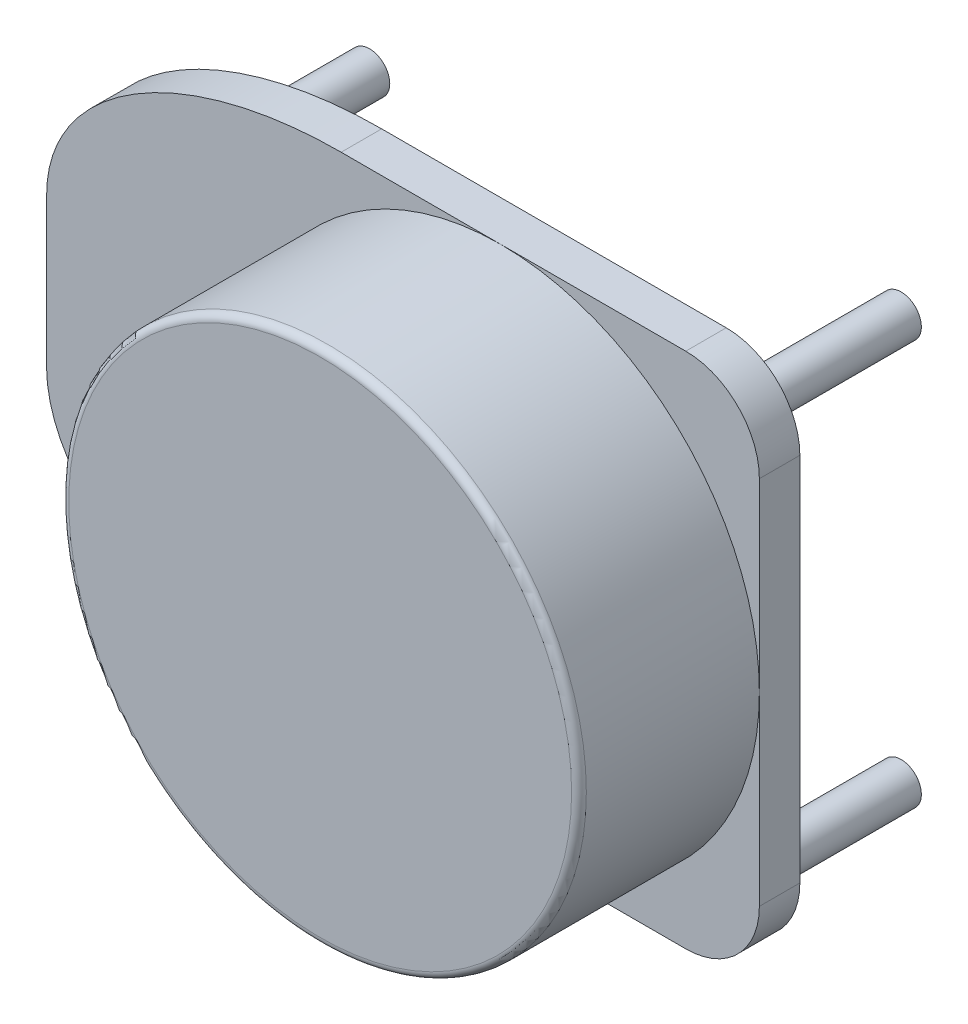
ISO-10303-21;
HEADER;
FILE_DESCRIPTION(('STEP AP214'),'2;1');
FILE_NAME('part.step','',(''),(''),'','','');
FILE_SCHEMA(('AUTOMOTIVE_DESIGN { 1 0 10303 214 1 1 1 1 }'));
ENDSEC;
DATA;
#1=APPLICATION_CONTEXT('core data for automotive mechanical design processes');
#2=APPLICATION_PROTOCOL_DEFINITION('international standard','automotive_design',2000,#1);
#3=PRODUCT_CONTEXT('',#1,'mechanical');
#4=PRODUCT('Part','Part','',(#3));
#5=PRODUCT_RELATED_PRODUCT_CATEGORY('part','',(#4));
#6=PRODUCT_DEFINITION_FORMATION('','',#4);
#7=PRODUCT_DEFINITION_CONTEXT('part definition',#1,'design');
#8=PRODUCT_DEFINITION('design','',#6,#7);
#9=PRODUCT_DEFINITION_SHAPE('','',#8);
#10=(LENGTH_UNIT() NAMED_UNIT(*) SI_UNIT(.MILLI.,.METRE.));
#11=(NAMED_UNIT(*) PLANE_ANGLE_UNIT() SI_UNIT($,.RADIAN.));
#12=(NAMED_UNIT(*) SI_UNIT($,.STERADIAN.) SOLID_ANGLE_UNIT());
#13=UNCERTAINTY_MEASURE_WITH_UNIT(LENGTH_MEASURE(1.E-05),#10,'distance_accuracy_value','');
#14=(GEOMETRIC_REPRESENTATION_CONTEXT(3) GLOBAL_UNCERTAINTY_ASSIGNED_CONTEXT((#13)) GLOBAL_UNIT_ASSIGNED_CONTEXT((#10,
#11,#12)) REPRESENTATION_CONTEXT('',''));
#15=CARTESIAN_POINT('',(0.,0.,0.));
#16=DIRECTION('',(0.,0.,1.));
#17=DIRECTION('',(1.,0.,0.));
#18=AXIS2_PLACEMENT_3D('',#15,#16,#17);
#19=CARTESIAN_POINT('',(-9.99999999999999,60.3,0.));
#20=DIRECTION('',(0.,0.,1.));
#21=DIRECTION('',(1.,0.,0.));
#22=AXIS2_PLACEMENT_3D('',#19,#20,#21);
#23=PLANE('',#22);
#24=CARTESIAN_POINT('',(-35.15,35.15,0.));
#25=DIRECTION('',(0.,0.,1.));
#26=DIRECTION('',(1.,0.,0.));
#27=AXIS2_PLACEMENT_3D('',#24,#25,#26);
#28=CIRCLE('',#27,35.15);
#29=CARTESIAN_POINT('',(0.,35.15,0.));
#30=VERTEX_POINT('',#29);
#31=CARTESIAN_POINT('',(-35.15,70.3,0.));
#32=VERTEX_POINT('',#31);
#33=EDGE_CURVE('E348',#30,#32,#28,.T.);
#34=ORIENTED_EDGE('',*,*,#33,.F.);
#35=DIRECTION('',(0.,1.,0.));
#36=VECTOR('',#35,1.);
#37=CARTESIAN_POINT('',(0.,10.0000000000001,0.));
#38=LINE('',#37,#36);
#39=CARTESIAN_POINT('',(0.,60.2999999999999,0.));
#40=VERTEX_POINT('',#39);
#41=EDGE_CURVE('E442',#30,#40,#38,.T.);
#42=ORIENTED_EDGE('',*,*,#41,.T.);
#43=CARTESIAN_POINT('',(-9.99999999999999,60.3,0.));
#44=DIRECTION('',(0.,0.,1.));
#45=DIRECTION('',(1.,0.,0.));
#46=AXIS2_PLACEMENT_3D('',#43,#44,#45);
#47=CIRCLE('',#46,10.);
#48=CARTESIAN_POINT('',(-10.0000000000001,70.3,0.));
#49=VERTEX_POINT('',#48);
#50=EDGE_CURVE('E354',#40,#49,#47,.T.);
#51=ORIENTED_EDGE('',*,*,#50,.T.);
#52=DIRECTION('',(-1.,0.,0.));
#53=VECTOR('',#52,1.);
#54=CARTESIAN_POINT('',(-10.0000000000001,70.3,0.));
#55=LINE('',#54,#53);
#56=EDGE_CURVE('E459',#49,#32,#55,.T.);
#57=ORIENTED_EDGE('',*,*,#56,.T.);
#58=EDGE_LOOP('',(#34,#42,#51,#57));
#59=FACE_BOUND('',#58,.T.);
#60=ADVANCED_FACE('F42',(#59),#23,.T.);
#61=CARTESIAN_POINT('',(-56.8,70.2999999999999,0.));
#62=VERTEX_POINT('',#61);
#63=EDGE_CURVE('E358',#32,#62,#55,.T.);
#64=ORIENTED_EDGE('',*,*,#63,.T.);
#65=CARTESIAN_POINT('',(-96.8,45.3,0.));
#66=CARTESIAN_POINT('',(-96.7999999999999,70.3,0.));
#67=CARTESIAN_POINT('',(-56.8,70.3,0.));
#68=(BOUNDED_CURVE() B_SPLINE_CURVE(2,(#65,#66,#67),.UNSPECIFIED.,.F.,
.F.) B_SPLINE_CURVE_WITH_KNOTS((3,3),(0.,1.),
.UNSPECIFIED.) CURVE() GEOMETRIC_REPRESENTATION_ITEM() RATIONAL_B_SPLINE_CURVE((1.,
0.707106781186548,1.)) REPRESENTATION_ITEM(''));
#69=CARTESIAN_POINT('',(-96.8,45.3,0.));
#70=VERTEX_POINT('',#69);
#71=EDGE_CURVE('E236',#62,#70,#68,.F.);
#72=ORIENTED_EDGE('',*,*,#71,.T.);
#73=DIRECTION('',(0.,1.,0.));
#74=VECTOR('',#73,1.);
#75=CARTESIAN_POINT('',(-96.8,0.,0.));
#76=LINE('',#75,#74);
#77=CARTESIAN_POINT('',(-96.8,25.,0.));
#78=VERTEX_POINT('',#77);
#79=EDGE_CURVE('E437',#78,#70,#76,.T.);
#80=ORIENTED_EDGE('',*,*,#79,.F.);
#81=CARTESIAN_POINT('',(-56.8,0.,0.));
#82=CARTESIAN_POINT('',(-96.8,0.,0.));
#83=CARTESIAN_POINT('',(-96.8,25.,0.));
#84=(BOUNDED_CURVE() B_SPLINE_CURVE(2,(#81,#82,#83),.UNSPECIFIED.,.F.,
.F.) B_SPLINE_CURVE_WITH_KNOTS((3,3),(0.,1.),
.UNSPECIFIED.) CURVE() GEOMETRIC_REPRESENTATION_ITEM() RATIONAL_B_SPLINE_CURVE((1.,
0.707106781186548,1.)) REPRESENTATION_ITEM(''));
#85=CARTESIAN_POINT('',(-56.8,0.,0.));
#86=VERTEX_POINT('',#85);
#87=EDGE_CURVE('E294',#78,#86,#84,.F.);
#88=ORIENTED_EDGE('',*,*,#87,.T.);
#89=DIRECTION('',(-1.,0.,0.));
#90=VECTOR('',#89,1.);
#91=CARTESIAN_POINT('',(-10.0000000000001,0.,0.));
#92=LINE('',#91,#90);
#93=CARTESIAN_POINT('',(-35.15,0.,0.));
#94=VERTEX_POINT('',#93);
#95=EDGE_CURVE('E436',#94,#86,#92,.T.);
#96=ORIENTED_EDGE('',*,*,#95,.F.);
#97=EDGE_CURVE('E341',#32,#94,#28,.T.);
#98=ORIENTED_EDGE('',*,*,#97,.F.);
#99=EDGE_LOOP('',(#64,#72,#80,#88,#96,#98));
#100=FACE_BOUND('',#99,.T.);
#101=ADVANCED_FACE('F417',(#100),#23,.T.);
#102=CARTESIAN_POINT('',(-9.99999999999999,60.3,-5.50000000000001));
#103=DIRECTION('',(0.,0.,1.));
#104=DIRECTION('',(1.,0.,0.));
#105=AXIS2_PLACEMENT_3D('',#102,#103,#104);
#106=CYLINDRICAL_SURFACE('',#105,10.);
#107=ORIENTED_EDGE('',*,*,#50,.F.);
#108=DIRECTION('',(0.,0.,1.));
#109=VECTOR('',#108,1.);
#110=CARTESIAN_POINT('',(0.,60.2999999999999,-5.50000000000001));
#111=LINE('',#110,#109);
#112=CARTESIAN_POINT('',(0.,60.2999999999999,-5.50000000000001));
#113=VERTEX_POINT('',#112);
#114=EDGE_CURVE('E352',#113,#40,#111,.T.);
#115=ORIENTED_EDGE('',*,*,#114,.F.);
#116=CARTESIAN_POINT('',(-9.99999999999999,60.3,-5.50000000000001));
#117=DIRECTION('',(0.,0.,1.));
#118=DIRECTION('',(1.,0.,0.));
#119=AXIS2_PLACEMENT_3D('',#116,#117,#118);
#120=CIRCLE('',#119,10.);
#121=CARTESIAN_POINT('',(-10.0000000000001,70.3,-5.50000000000001));
#122=VERTEX_POINT('',#121);
#123=EDGE_CURVE('E141',#113,#122,#120,.T.);
#124=ORIENTED_EDGE('',*,*,#123,.T.);
#125=DIRECTION('',(0.,0.,1.));
#126=VECTOR('',#125,1.);
#127=CARTESIAN_POINT('',(-10.0000000000001,70.3,-5.50000000000001));
#128=LINE('',#127,#126);
#129=EDGE_CURVE('E474',#122,#49,#128,.T.);
#130=ORIENTED_EDGE('',*,*,#129,.T.);
#131=EDGE_LOOP('',(#107,#115,#124,#130));
#132=FACE_BOUND('',#131,.T.);
#133=ADVANCED_FACE('F259',(#132),#106,.T.);
#134=CARTESIAN_POINT('',(0.,10.0000000000001,-5.50000000000001));
#135=DIRECTION('',(1.,0.,0.));
#136=DIRECTION('',(0.,0.,-1.));
#137=AXIS2_PLACEMENT_3D('',#134,#135,#136);
#138=PLANE('',#137);
#139=CARTESIAN_POINT('',(0.,9.99999999999998,0.));
#140=VERTEX_POINT('',#139);
#141=EDGE_CURVE('E434',#140,#30,#38,.T.);
#142=ORIENTED_EDGE('',*,*,#141,.F.);
#143=DIRECTION('',(0.,0.,1.));
#144=VECTOR('',#143,1.);
#145=CARTESIAN_POINT('',(0.,9.99999999999998,-5.50000000000001));
#146=LINE('',#145,#144);
#147=CARTESIAN_POINT('',(0.,9.99999999999998,-5.50000000000001));
#148=VERTEX_POINT('',#147);
#149=EDGE_CURVE('E480',#148,#140,#146,.T.);
#150=ORIENTED_EDGE('',*,*,#149,.F.);
#151=DIRECTION('',(0.,1.,0.));
#152=VECTOR('',#151,1.);
#153=CARTESIAN_POINT('',(0.,10.0000000000001,-5.50000000000001));
#154=LINE('',#153,#152);
#155=EDGE_CURVE('E472',#148,#113,#154,.T.);
#156=ORIENTED_EDGE('',*,*,#155,.T.);
#157=ORIENTED_EDGE('',*,*,#114,.T.);
#158=ORIENTED_EDGE('',*,*,#41,.F.);
#159=EDGE_LOOP('',(#142,#150,#156,#157,#158));
#160=FACE_BOUND('',#159,.T.);
#161=ADVANCED_FACE('F485',(#160),#138,.T.);
#162=CARTESIAN_POINT('',(-10.,9.99999999999998,-5.50000000000001));
#163=DIRECTION('',(0.,0.,1.));
#164=DIRECTION('',(1.,0.,0.));
#165=AXIS2_PLACEMENT_3D('',#162,#163,#164);
#166=CYLINDRICAL_SURFACE('',#165,10.);
#167=CARTESIAN_POINT('',(-10.,9.99999999999998,0.));
#168=DIRECTION('',(0.,0.,1.));
#169=DIRECTION('',(1.,0.,0.));
#170=AXIS2_PLACEMENT_3D('',#167,#168,#169);
#171=CIRCLE('',#170,10.);
#172=CARTESIAN_POINT('',(-10.0000000000001,0.,0.));
#173=VERTEX_POINT('',#172);
#174=EDGE_CURVE('E440',#173,#140,#171,.T.);
#175=ORIENTED_EDGE('',*,*,#174,.F.);
#176=DIRECTION('',(0.,0.,1.));
#177=VECTOR('',#176,1.);
#178=CARTESIAN_POINT('',(-10.0000000000001,0.,-5.50000000000001));
#179=LINE('',#178,#177);
#180=CARTESIAN_POINT('',(-10.0000000000001,0.,-5.50000000000001));
#181=VERTEX_POINT('',#180);
#182=EDGE_CURVE('E439',#181,#173,#179,.T.);
#183=ORIENTED_EDGE('',*,*,#182,.F.);
#184=CARTESIAN_POINT('',(-10.,9.99999999999998,-5.50000000000001));
#185=DIRECTION('',(0.,0.,1.));
#186=DIRECTION('',(1.,0.,0.));
#187=AXIS2_PLACEMENT_3D('',#184,#185,#186);
#188=CIRCLE('',#187,10.);
#189=EDGE_CURVE('E195',#181,#148,#188,.T.);
#190=ORIENTED_EDGE('',*,*,#189,.T.);
#191=ORIENTED_EDGE('',*,*,#149,.T.);
#192=EDGE_LOOP('',(#175,#183,#190,#191));
#193=FACE_BOUND('',#192,.T.);
#194=ADVANCED_FACE('F479',(#193),#166,.T.);
#195=CARTESIAN_POINT('',(-10.0000000000001,0.,-5.50000000000001));
#196=DIRECTION('',(0.,1.,0.));
#197=DIRECTION('',(0.,0.,1.));
#198=AXIS2_PLACEMENT_3D('',#195,#196,#197);
#199=PLANE('',#198);
#200=ORIENTED_EDGE('',*,*,#95,.T.);
#201=CARTESIAN_POINT('',(-56.8,0.,-5.77499999999997));
#202=CARTESIAN_POINT('',(-56.8,0.,-3.75833333333336));
#203=CARTESIAN_POINT('',(-56.8,0.,-1.74166666666664));
#204=CARTESIAN_POINT('',(-56.8,0.,0.275000000000025));
#205=(BOUNDED_CURVE() B_SPLINE_CURVE(3,(#201,#202,#203,#204),.UNSPECIFIED.,.F.,
.F.) B_SPLINE_CURVE_WITH_KNOTS((4,4),(-0.000275,0.005775),
.UNSPECIFIED.) CURVE() GEOMETRIC_REPRESENTATION_ITEM() RATIONAL_B_SPLINE_CURVE((1.,1.,1.,1.)) REPRESENTATION_ITEM(''));
#206=CARTESIAN_POINT('',(-56.8,0.,-5.50000000000001));
#207=VERTEX_POINT('',#206);
#208=EDGE_CURVE('E56',#86,#207,#205,.F.);
#209=ORIENTED_EDGE('',*,*,#208,.T.);
#210=DIRECTION('',(-1.,0.,0.));
#211=VECTOR('',#210,1.);
#212=CARTESIAN_POINT('',(-10.0000000000001,0.,-5.50000000000001));
#213=LINE('',#212,#211);
#214=EDGE_CURVE('E130',#181,#207,#213,.T.);
#215=ORIENTED_EDGE('',*,*,#214,.F.);
#216=ORIENTED_EDGE('',*,*,#182,.T.);
#217=EDGE_CURVE('E431',#173,#94,#92,.T.);
#218=ORIENTED_EDGE('',*,*,#217,.T.);
#219=EDGE_LOOP('',(#200,#209,#215,#216,#218));
#220=FACE_BOUND('',#219,.T.);
#221=ADVANCED_FACE('F181',(#220),#199,.F.);
#222=CARTESIAN_POINT('',(-96.8,0.,-5.50000000000001));
#223=DIRECTION('',(1.,0.,0.));
#224=DIRECTION('',(0.,0.,-1.));
#225=AXIS2_PLACEMENT_3D('',#222,#223,#224);
#226=PLANE('',#225);
#227=ORIENTED_EDGE('',*,*,#79,.T.);
#228=CARTESIAN_POINT('',(-96.8,45.3,-5.77499999999997));
#229=CARTESIAN_POINT('',(-96.8,45.3,-3.75833333333331));
#230=CARTESIAN_POINT('',(-96.8,45.3,-1.74166666666664));
#231=CARTESIAN_POINT('',(-96.8,45.3,0.275000000000025));
#232=(BOUNDED_CURVE() B_SPLINE_CURVE(3,(#228,#229,#230,#231),.UNSPECIFIED.,.F.,
.F.) B_SPLINE_CURVE_WITH_KNOTS((4,4),(-0.005775,0.000275),
.UNSPECIFIED.) CURVE() GEOMETRIC_REPRESENTATION_ITEM() RATIONAL_B_SPLINE_CURVE((1.,1.,1.,1.)) REPRESENTATION_ITEM(''));
#233=CARTESIAN_POINT('',(-96.8,45.3,-5.50000000000001));
#234=VERTEX_POINT('',#233);
#235=EDGE_CURVE('E135',#70,#234,#232,.F.);
#236=ORIENTED_EDGE('',*,*,#235,.T.);
#237=DIRECTION('',(0.,1.,0.));
#238=VECTOR('',#237,1.);
#239=CARTESIAN_POINT('',(-96.8,0.,-5.50000000000001));
#240=LINE('',#239,#238);
#241=CARTESIAN_POINT('',(-96.8,35.15,-5.50000000000001));
#242=VERTEX_POINT('',#241);
#243=EDGE_CURVE('E65',#242,#234,#240,.T.);
#244=ORIENTED_EDGE('',*,*,#243,.F.);
#245=CARTESIAN_POINT('',(-96.8,25.,-5.50000000000001));
#246=VERTEX_POINT('',#245);
#247=EDGE_CURVE('E120',#246,#242,#240,.T.);
#248=ORIENTED_EDGE('',*,*,#247,.F.);
#249=CARTESIAN_POINT('',(-96.8,25.,0.275000000000025));
#250=CARTESIAN_POINT('',(-96.8,25.,-1.74166666666664));
#251=CARTESIAN_POINT('',(-96.8,25.,-3.75833333333336));
#252=CARTESIAN_POINT('',(-96.8,25.,-5.77499999999997));
#253=(BOUNDED_CURVE() B_SPLINE_CURVE(3,(#249,#250,#251,#252),.UNSPECIFIED.,.F.,
.F.) B_SPLINE_CURVE_WITH_KNOTS((4,4),(-0.000275,0.005775),
.UNSPECIFIED.) CURVE() GEOMETRIC_REPRESENTATION_ITEM() RATIONAL_B_SPLINE_CURVE((1.,1.,1.,1.)) REPRESENTATION_ITEM(''));
#254=EDGE_CURVE('E165',#246,#78,#253,.F.);
#255=ORIENTED_EDGE('',*,*,#254,.T.);
#256=EDGE_LOOP('',(#227,#236,#244,#248,#255));
#257=FACE_BOUND('',#256,.T.);
#258=ADVANCED_FACE('F133',(#257),#226,.F.);
#259=CARTESIAN_POINT('',(-10.0000000000001,70.3,-5.50000000000001));
#260=DIRECTION('',(0.,1.,0.));
#261=DIRECTION('',(-1.,0.,0.));
#262=AXIS2_PLACEMENT_3D('',#259,#260,#261);
#263=PLANE('',#262);
#264=DIRECTION('',(-1.,0.,0.));
#265=VECTOR('',#264,1.);
#266=CARTESIAN_POINT('',(-10.0000000000001,70.3,-5.50000000000001));
#267=LINE('',#266,#265);
#268=CARTESIAN_POINT('',(-56.8,70.2999999999999,-5.50000000000001));
#269=VERTEX_POINT('',#268);
#270=EDGE_CURVE('E138',#122,#269,#267,.T.);
#271=ORIENTED_EDGE('',*,*,#270,.T.);
#272=CARTESIAN_POINT('',(-56.8,70.3,0.275000000000025));
#273=CARTESIAN_POINT('',(-56.8,70.3,-1.74166666666664));
#274=CARTESIAN_POINT('',(-56.8,70.3,-3.75833333333331));
#275=CARTESIAN_POINT('',(-56.8,70.3,-5.77499999999997));
#276=(BOUNDED_CURVE() B_SPLINE_CURVE(3,(#272,#273,#274,#275),.UNSPECIFIED.,.F.,
.F.) B_SPLINE_CURVE_WITH_KNOTS((4,4),(-0.005775,0.000275),
.UNSPECIFIED.) CURVE() GEOMETRIC_REPRESENTATION_ITEM() RATIONAL_B_SPLINE_CURVE((1.,1.,1.,1.)) REPRESENTATION_ITEM(''));
#277=EDGE_CURVE('E338',#269,#62,#276,.F.);
#278=ORIENTED_EDGE('',*,*,#277,.T.);
#279=ORIENTED_EDGE('',*,*,#63,.F.);
#280=ORIENTED_EDGE('',*,*,#56,.F.);
#281=ORIENTED_EDGE('',*,*,#129,.F.);
#282=EDGE_LOOP('',(#271,#278,#279,#280,#281));
#283=FACE_BOUND('',#282,.T.);
#284=ADVANCED_FACE('F180',(#283),#263,.T.);
#285=CARTESIAN_POINT('',(-9.99999999999999,60.3,-5.50000000000001));
#286=DIRECTION('',(0.,0.,1.));
#287=DIRECTION('',(1.,0.,0.));
#288=AXIS2_PLACEMENT_3D('',#285,#286,#287);
#289=PLANE('',#288);
#290=CARTESIAN_POINT('',(-79.45,55.15,-5.50000000000001));
#291=DIRECTION('',(0.,0.,1.));
#292=DIRECTION('',(1.,0.,0.));
#293=AXIS2_PLACEMENT_3D('',#290,#291,#292);
#294=CIRCLE('',#293,2.75000000000001);
#295=CARTESIAN_POINT('',(-76.7,55.15,-5.50000000000001));
#296=VERTEX_POINT('',#295);
#297=EDGE_CURVE('E12',#296,#296,#294,.F.);
#298=ORIENTED_EDGE('',*,*,#297,.F.);
#299=EDGE_LOOP('',(#298));
#300=FACE_BOUND('',#299,.T.);
#301=CARTESIAN_POINT('',(-7.24999999999999,62.65,-5.50000000000001));
#302=DIRECTION('',(0.,0.,1.));
#303=DIRECTION('',(1.,0.,0.));
#304=AXIS2_PLACEMENT_3D('',#301,#302,#303);
#305=CIRCLE('',#304,2.75);
#306=CARTESIAN_POINT('',(-4.49999999999999,62.65,-5.50000000000001));
#307=VERTEX_POINT('',#306);
#308=EDGE_CURVE('E49',#307,#307,#305,.F.);
#309=ORIENTED_EDGE('',*,*,#308,.F.);
#310=EDGE_LOOP('',(#309));
#311=FACE_BOUND('',#310,.T.);
#312=CARTESIAN_POINT('',(-7.25000000000001,7.64999999999996,-5.50000000000001));
#313=DIRECTION('',(0.,0.,1.));
#314=DIRECTION('',(1.,0.,0.));
#315=AXIS2_PLACEMENT_3D('',#312,#313,#314);
#316=CIRCLE('',#315,2.75);
#317=CARTESIAN_POINT('',(-4.50000000000001,7.64999999999996,-5.50000000000001));
#318=VERTEX_POINT('',#317);
#319=EDGE_CURVE('E395',#318,#318,#316,.F.);
#320=ORIENTED_EDGE('',*,*,#319,.F.);
#321=EDGE_LOOP('',(#320));
#322=FACE_BOUND('',#321,.T.);
#323=CARTESIAN_POINT('',(-79.45,15.15,-5.50000000000001));
#324=DIRECTION('',(0.,0.,1.));
#325=DIRECTION('',(1.,0.,0.));
#326=AXIS2_PLACEMENT_3D('',#323,#324,#325);
#327=CIRCLE('',#326,2.75000000000001);
#328=CARTESIAN_POINT('',(-76.7,15.15,-5.50000000000001));
#329=VERTEX_POINT('',#328);
#330=EDGE_CURVE('E148',#329,#329,#327,.F.);
#331=ORIENTED_EDGE('',*,*,#330,.F.);
#332=EDGE_LOOP('',(#331));
#333=FACE_BOUND('',#332,.T.);
#334=ORIENTED_EDGE('',*,*,#247,.T.);
#335=CARTESIAN_POINT('',(-80.9,35.15,-5.50000000000001));
#336=DIRECTION('',(0.,0.,-1.));
#337=DIRECTION('',(-1.,0.,0.));
#338=AXIS2_PLACEMENT_3D('',#335,#336,#337);
#339=CIRCLE('',#338,15.9);
#340=EDGE_CURVE('E123',#242,#242,#339,.T.);
#341=ORIENTED_EDGE('',*,*,#340,.F.);
#342=ORIENTED_EDGE('',*,*,#243,.T.);
#343=CARTESIAN_POINT('',(-56.8,70.3,-5.49999999999997));
#344=CARTESIAN_POINT('',(-96.8,70.3,-5.50000000000002));
#345=CARTESIAN_POINT('',(-96.8,45.3,-5.49999999999997));
#346=(BOUNDED_CURVE() B_SPLINE_CURVE(2,(#343,#344,#345),.UNSPECIFIED.,.F.,
.F.) B_SPLINE_CURVE_WITH_KNOTS((3,3),(0.,1.),
.UNSPECIFIED.) CURVE() GEOMETRIC_REPRESENTATION_ITEM() RATIONAL_B_SPLINE_CURVE((1.,
0.707106781186548,1.)) REPRESENTATION_ITEM(''));
#347=EDGE_CURVE('E334',#234,#269,#346,.F.);
#348=ORIENTED_EDGE('',*,*,#347,.T.);
#349=ORIENTED_EDGE('',*,*,#270,.F.);
#350=ORIENTED_EDGE('',*,*,#123,.F.);
#351=ORIENTED_EDGE('',*,*,#155,.F.);
#352=ORIENTED_EDGE('',*,*,#189,.F.);
#353=ORIENTED_EDGE('',*,*,#214,.T.);
#354=CARTESIAN_POINT('',(-96.8,25.,-5.49999999999998));
#355=CARTESIAN_POINT('',(-96.8,0.,-5.50000000000002));
#356=CARTESIAN_POINT('',(-56.8,0.,-5.49999999999998));
#357=(BOUNDED_CURVE() B_SPLINE_CURVE(2,(#354,#355,#356),.UNSPECIFIED.,.F.,
.F.) B_SPLINE_CURVE_WITH_KNOTS((3,3),(0.,1.),
.UNSPECIFIED.) CURVE() GEOMETRIC_REPRESENTATION_ITEM() RATIONAL_B_SPLINE_CURVE((1.,
0.707106781186548,1.)) REPRESENTATION_ITEM(''));
#358=EDGE_CURVE('E125',#207,#246,#357,.F.);
#359=ORIENTED_EDGE('',*,*,#358,.T.);
#360=EDGE_LOOP('',(#334,#341,#342,#348,#349,#350,#351,#352,#353,#359));
#361=FACE_BOUND('',#360,.T.);
#362=ADVANCED_FACE('F121',(#300,#311,#322,#333,#361),#289,.F.);
#363=EDGE_CURVE('E346',#94,#30,#28,.T.);
#364=ORIENTED_EDGE('',*,*,#363,.F.);
#365=ORIENTED_EDGE('',*,*,#217,.F.);
#366=ORIENTED_EDGE('',*,*,#174,.T.);
#367=ORIENTED_EDGE('',*,*,#141,.T.);
#368=EDGE_LOOP('',(#364,#365,#366,#367));
#369=FACE_BOUND('',#368,.T.);
#370=ADVANCED_FACE('F210',(#369),#23,.T.);
#371=CARTESIAN_POINT('',(-35.15,35.15,24.5));
#372=DIRECTION('',(0.,0.,-1.));
#373=DIRECTION('',(-1.,0.,0.));
#374=AXIS2_PLACEMENT_3D('',#371,#372,#373);
#375=CYLINDRICAL_SURFACE('',#374,35.15);
#376=CARTESIAN_POINT('',(-35.15,35.15,23.5));
#377=DIRECTION('',(0.,0.,1.));
#378=DIRECTION('',(1.,0.,0.));
#379=AXIS2_PLACEMENT_3D('',#376,#377,#378);
#380=CIRCLE('',#379,35.15);
#381=CARTESIAN_POINT('',(0.,35.15,23.5));
#382=VERTEX_POINT('',#381);
#383=EDGE_CURVE('E146',#382,#382,#380,.F.);
#384=ORIENTED_EDGE('',*,*,#383,.T.);
#385=EDGE_LOOP('',(#384));
#386=FACE_BOUND('',#385,.T.);
#387=ORIENTED_EDGE('',*,*,#33,.T.);
#388=ORIENTED_EDGE('',*,*,#97,.T.);
#389=ORIENTED_EDGE('',*,*,#363,.T.);
#390=EDGE_LOOP('',(#387,#388,#389));
#391=FACE_BOUND('',#390,.T.);
#392=ADVANCED_FACE('F212',(#386,#391),#375,.T.);
#393=CARTESIAN_POINT('',(0.,0.,24.5));
#394=DIRECTION('',(0.,0.,1.));
#395=DIRECTION('',(1.,0.,0.));
#396=AXIS2_PLACEMENT_3D('',#393,#394,#395);
#397=PLANE('',#396);
#398=CARTESIAN_POINT('',(-35.15,35.15,24.5));
#399=DIRECTION('',(0.,0.,1.));
#400=DIRECTION('',(1.,0.,0.));
#401=AXIS2_PLACEMENT_3D('',#398,#399,#400);
#402=CIRCLE('',#401,34.15);
#403=CARTESIAN_POINT('',(-1.,35.15,24.5));
#404=VERTEX_POINT('',#403);
#405=EDGE_CURVE('E324',#404,#404,#402,.T.);
#406=ORIENTED_EDGE('',*,*,#405,.T.);
#407=EDGE_LOOP('',(#406));
#408=FACE_BOUND('',#407,.T.);
#409=ADVANCED_FACE('F258',(#408),#397,.T.);
#410=CARTESIAN_POINT('',(-96.8,45.3,0.275000000000025));
#411=CARTESIAN_POINT('',(-96.8,45.3,-1.74166666666664));
#412=CARTESIAN_POINT('',(-96.8,45.3,-3.75833333333331));
#413=CARTESIAN_POINT('',(-96.8,45.3,-5.77499999999997));
#414=CARTESIAN_POINT('',(-96.8,70.3,0.274999999999986));
#415=CARTESIAN_POINT('',(-96.8,70.3,-1.74166666666663));
#416=CARTESIAN_POINT('',(-96.8,70.3,-3.75833333333333));
#417=CARTESIAN_POINT('',(-96.8,70.3,-5.77500000000002));
#418=CARTESIAN_POINT('',(-56.8,70.3,0.275000000000025));
#419=CARTESIAN_POINT('',(-56.8,70.3,-1.74166666666664));
#420=CARTESIAN_POINT('',(-56.8,70.3,-3.75833333333331));
#421=CARTESIAN_POINT('',(-56.8,70.3,-5.77499999999997));
#422=(BOUNDED_SURFACE() B_SPLINE_SURFACE(2,3,((#410,#411,#412,#413),(#414,#415,#416,#417),(#418,
#419,#420,#421)),.UNSPECIFIED.,.F.,.F.,.F.) B_SPLINE_SURFACE_WITH_KNOTS((3,3),(4,4),(0.,1.),
(-0.005775,0.000275),
.UNSPECIFIED.) GEOMETRIC_REPRESENTATION_ITEM() RATIONAL_B_SPLINE_SURFACE(((1.,1.,1.,1.),
(0.707106781186548,0.707106781186548,0.707106781186548,0.707106781186548),(1.,1.,1.,1.))) REPRESENTATION_ITEM('') SURFACE());
#423=ORIENTED_EDGE('',*,*,#347,.F.);
#424=ORIENTED_EDGE('',*,*,#235,.F.);
#425=ORIENTED_EDGE('',*,*,#71,.F.);
#426=ORIENTED_EDGE('',*,*,#277,.F.);
#427=EDGE_LOOP('',(#423,#424,#425,#426));
#428=FACE_BOUND('',#427,.T.);
#429=ADVANCED_FACE('F244',(#428),#422,.T.);
#430=CARTESIAN_POINT('',(-96.8,25.,-5.77499999999997));
#431=CARTESIAN_POINT('',(-96.8,25.,-3.75833333333336));
#432=CARTESIAN_POINT('',(-96.8,25.,-1.74166666666664));
#433=CARTESIAN_POINT('',(-96.8,25.,0.275000000000025));
#434=CARTESIAN_POINT('',(-96.8,0.,-5.77500000000003));
#435=CARTESIAN_POINT('',(-96.8,0.,-3.75833333333333));
#436=CARTESIAN_POINT('',(-96.8,0.,-1.74166666666663));
#437=CARTESIAN_POINT('',(-96.8,0.,0.274999999999986));
#438=CARTESIAN_POINT('',(-56.8,0.,-5.77499999999997));
#439=CARTESIAN_POINT('',(-56.8,0.,-3.75833333333336));
#440=CARTESIAN_POINT('',(-56.8,0.,-1.74166666666664));
#441=CARTESIAN_POINT('',(-56.8,0.,0.275000000000025));
#442=(BOUNDED_SURFACE() B_SPLINE_SURFACE(2,3,((#430,#431,#432,#433),(#434,#435,#436,#437),(#438,
#439,#440,#441)),.UNSPECIFIED.,.F.,.F.,.F.) B_SPLINE_SURFACE_WITH_KNOTS((3,3),(4,4),(0.,1.),
(-0.000275,0.005775),
.UNSPECIFIED.) GEOMETRIC_REPRESENTATION_ITEM() RATIONAL_B_SPLINE_SURFACE(((1.,1.,1.,1.),
(0.707106781186548,0.707106781186548,0.707106781186548,0.707106781186548),(1.,1.,1.,1.))) REPRESENTATION_ITEM('') SURFACE());
#443=ORIENTED_EDGE('',*,*,#358,.F.);
#444=ORIENTED_EDGE('',*,*,#208,.F.);
#445=ORIENTED_EDGE('',*,*,#87,.F.);
#446=ORIENTED_EDGE('',*,*,#254,.F.);
#447=EDGE_LOOP('',(#443,#444,#445,#446));
#448=FACE_BOUND('',#447,.T.);
#449=ADVANCED_FACE('F257',(#448),#442,.T.);
#450=CARTESIAN_POINT('',(-35.15,35.15,23.5));
#451=DIRECTION('',(0.,0.,1.));
#452=DIRECTION('',(1.,0.,0.));
#453=AXIS2_PLACEMENT_3D('',#450,#451,#452);
#454=TOROIDAL_SURFACE('',#453,34.15,1.);
#455=ORIENTED_EDGE('',*,*,#383,.F.);
#456=EDGE_LOOP('',(#455));
#457=FACE_BOUND('',#456,.T.);
#458=ORIENTED_EDGE('',*,*,#405,.F.);
#459=EDGE_LOOP('',(#458));
#460=FACE_BOUND('',#459,.T.);
#461=ADVANCED_FACE('F44',(#457,#460),#454,.T.);
#462=CARTESIAN_POINT('',(-80.9,35.15,-21.));
#463=DIRECTION('',(0.,0.,1.));
#464=DIRECTION('',(1.,0.,0.));
#465=AXIS2_PLACEMENT_3D('',#462,#463,#464);
#466=CYLINDRICAL_SURFACE('',#465,15.9);
#467=CARTESIAN_POINT('',(-80.9,35.15,-21.));
#468=DIRECTION('',(0.,0.,-1.));
#469=DIRECTION('',(-1.,0.,0.));
#470=AXIS2_PLACEMENT_3D('',#467,#468,#469);
#471=CIRCLE('',#470,15.9);
#472=CARTESIAN_POINT('',(-96.8,35.15,-21.));
#473=VERTEX_POINT('',#472);
#474=EDGE_CURVE('E355',#473,#473,#471,.T.);
#475=ORIENTED_EDGE('',*,*,#474,.F.);
#476=EDGE_LOOP('',(#475));
#477=FACE_BOUND('',#476,.T.);
#478=ORIENTED_EDGE('',*,*,#340,.T.);
#479=EDGE_LOOP('',(#478));
#480=FACE_BOUND('',#479,.T.);
#481=ADVANCED_FACE('F539',(#477,#480),#466,.T.);
#482=CARTESIAN_POINT('',(0.,0.,-21.));
#483=DIRECTION('',(0.,0.,-1.));
#484=DIRECTION('',(-1.,0.,0.));
#485=AXIS2_PLACEMENT_3D('',#482,#483,#484);
#486=PLANE('',#485);
#487=ORIENTED_EDGE('',*,*,#474,.T.);
#488=EDGE_LOOP('',(#487));
#489=FACE_BOUND('',#488,.T.);
#490=ADVANCED_FACE('F546',(#489),#486,.T.);
#491=CARTESIAN_POINT('',(-79.45,15.15,-26.5));
#492=DIRECTION('',(0.,0.,1.));
#493=DIRECTION('',(1.,0.,0.));
#494=AXIS2_PLACEMENT_3D('',#491,#492,#493);
#495=CYLINDRICAL_SURFACE('',#494,2.75000000000001);
#496=CARTESIAN_POINT('',(-79.45,15.15,-26.5));
#497=DIRECTION('',(0.,0.,-1.));
#498=DIRECTION('',(-1.,0.,0.));
#499=AXIS2_PLACEMENT_3D('',#496,#497,#498);
#500=CIRCLE('',#499,2.75000000000001);
#501=CARTESIAN_POINT('',(-76.7,15.15,-26.5));
#502=VERTEX_POINT('',#501);
#503=EDGE_CURVE('E364',#502,#502,#500,.T.);
#504=CARTESIAN_POINT('',(-76.7,15.15,-26.5));
#505=CARTESIAN_POINT('',(-76.7,15.15,-26.28125));
#506=CARTESIAN_POINT('',(-76.7,15.15,-26.0625));
#507=CARTESIAN_POINT('',(-76.7,15.15,-25.625));
#508=CARTESIAN_POINT('',(-76.7,15.15,-25.40625));
#509=CARTESIAN_POINT('',(-76.7,15.15,-24.96875));
#510=CARTESIAN_POINT('',(-76.7,15.15,-24.75));
#511=CARTESIAN_POINT('',(-76.7,15.15,-24.3125));
#512=CARTESIAN_POINT('',(-76.7,15.15,-24.09375));
#513=CARTESIAN_POINT('',(-76.7,15.15,-23.65625));
#514=CARTESIAN_POINT('',(-76.7,15.15,-23.4375));
#515=CARTESIAN_POINT('',(-76.7,15.15,-23.));
#516=CARTESIAN_POINT('',(-76.7,15.15,-22.78125));
#517=CARTESIAN_POINT('',(-76.7,15.15,-22.34375));
#518=CARTESIAN_POINT('',(-76.7,15.15,-22.125));
#519=CARTESIAN_POINT('',(-76.7,15.15,-21.6875));
#520=CARTESIAN_POINT('',(-76.7,15.15,-21.46875));
#521=CARTESIAN_POINT('',(-76.7,15.15,-21.03125));
#522=CARTESIAN_POINT('',(-76.7,15.15,-20.8125));
#523=CARTESIAN_POINT('',(-76.7,15.15,-20.375));
#524=CARTESIAN_POINT('',(-76.7,15.15,-20.15625));
#525=CARTESIAN_POINT('',(-76.7,15.15,-19.71875));
#526=CARTESIAN_POINT('',(-76.7,15.15,-19.5));
#527=CARTESIAN_POINT('',(-76.7,15.15,-19.0625));
#528=CARTESIAN_POINT('',(-76.7,15.15,-18.84375));
#529=CARTESIAN_POINT('',(-76.7,15.15,-18.40625));
#530=CARTESIAN_POINT('',(-76.7,15.15,-18.1875));
#531=CARTESIAN_POINT('',(-76.7,15.15,-17.75));
#532=CARTESIAN_POINT('',(-76.7,15.15,-17.53125));
#533=CARTESIAN_POINT('',(-76.7,15.15,-17.09375));
#534=CARTESIAN_POINT('',(-76.7,15.15,-16.875));
#535=CARTESIAN_POINT('',(-76.7,15.15,-16.4375));
#536=CARTESIAN_POINT('',(-76.7,15.15,-16.21875));
#537=CARTESIAN_POINT('',(-76.7,15.15,-15.78125));
#538=CARTESIAN_POINT('',(-76.7,15.15,-15.5625));
#539=CARTESIAN_POINT('',(-76.7,15.15,-15.125));
#540=CARTESIAN_POINT('',(-76.7,15.15,-14.90625));
#541=CARTESIAN_POINT('',(-76.7,15.15,-14.46875));
#542=CARTESIAN_POINT('',(-76.7,15.15,-14.25));
#543=CARTESIAN_POINT('',(-76.7,15.15,-13.8125));
#544=CARTESIAN_POINT('',(-76.7,15.15,-13.59375));
#545=CARTESIAN_POINT('',(-76.7,15.15,-13.15625));
#546=CARTESIAN_POINT('',(-76.7,15.15,-12.9375));
#547=CARTESIAN_POINT('',(-76.7,15.15,-12.5));
#548=CARTESIAN_POINT('',(-76.7,15.15,-12.28125));
#549=CARTESIAN_POINT('',(-76.7,15.15,-11.84375));
#550=CARTESIAN_POINT('',(-76.7,15.15,-11.625));
#551=CARTESIAN_POINT('',(-76.7,15.15,-11.1875));
#552=CARTESIAN_POINT('',(-76.7,15.15,-10.96875));
#553=CARTESIAN_POINT('',(-76.7,15.15,-10.53125));
#554=CARTESIAN_POINT('',(-76.7,15.15,-10.3125));
#555=CARTESIAN_POINT('',(-76.7,15.15,-9.87500000000001));
#556=CARTESIAN_POINT('',(-76.7,15.15,-9.65625000000001));
#557=CARTESIAN_POINT('',(-76.7,15.15,-9.21875000000001));
#558=CARTESIAN_POINT('',(-76.7,15.15,-9.00000000000001));
#559=CARTESIAN_POINT('',(-76.7,15.15,-8.56250000000001));
#560=CARTESIAN_POINT('',(-76.7,15.15,-8.34375000000001));
#561=CARTESIAN_POINT('',(-76.7,15.15,-7.90625000000001));
#562=CARTESIAN_POINT('',(-76.7,15.15,-7.68750000000001));
#563=CARTESIAN_POINT('',(-76.7,15.15,-7.25000000000001));
#564=CARTESIAN_POINT('',(-76.7,15.15,-7.03125000000001));
#565=CARTESIAN_POINT('',(-76.7,15.15,-6.59375000000001));
#566=CARTESIAN_POINT('',(-76.7,15.15,-6.37500000000001));
#567=CARTESIAN_POINT('',(-76.7,15.15,-5.93750000000001));
#568=CARTESIAN_POINT('',(-76.7,15.15,-5.71875000000001));
#569=CARTESIAN_POINT('',(-76.7,15.15,-5.50000000000001));
#570=B_SPLINE_CURVE_WITH_KNOTS('',3,(#504,#505,#506,#507,#508,#509,#510,#511,#512,#513,#514,
#515,#516,#517,#518,#519,#520,#521,#522,#523,#524,#525,#526,#527,#528,#529,#530,#531,#532,#533,
#534,#535,#536,#537,#538,#539,#540,#541,#542,#543,#544,#545,#546,#547,#548,#549,#550,#551,#552,
#553,#554,#555,#556,#557,#558,#559,#560,#561,#562,#563,#564,#565,#566,#567,#568,#569),
.UNSPECIFIED.,.F.,.F.,(4,2,2,2,2,2,2,2,2,2,2,2,2,2,2,2,2,2,2,2,2,2,2,2,2,2,2,2,2,2,2,2,4),(0.,
0.656250000000001,1.3125,1.96875,2.625,3.28125,3.9375,4.59375,5.25,5.90625000000001,
6.56250000000001,7.21875000000001,7.87500000000001,8.53125000000001,9.18750000000001,
9.84375000000001,10.5,11.15625,11.8125,12.46875,13.125,13.78125,14.4375,15.09375,15.75,16.40625,
17.0625,17.71875,18.375,19.03125,19.6875,20.34375,21.),.UNSPECIFIED.);
#571=EDGE_CURVE('BSEAM554',#502,#329,#570,.T.);
#572=ORIENTED_EDGE('',*,*,#503,.F.);
#573=ORIENTED_EDGE('',*,*,#330,.T.);
#574=ORIENTED_EDGE('',*,*,#571,.T.);
#575=ORIENTED_EDGE('',*,*,#571,.F.);
#576=EDGE_LOOP('',(#572,#574,#573,#575));
#577=FACE_BOUND('',#576,.T.);
#578=ADVANCED_FACE('F554',(#577),#495,.T.);
#579=CARTESIAN_POINT('',(0.,0.,-26.5));
#580=DIRECTION('',(0.,0.,-1.));
#581=DIRECTION('',(-1.,0.,0.));
#582=AXIS2_PLACEMENT_3D('',#579,#580,#581);
#583=PLANE('',#582);
#584=ORIENTED_EDGE('',*,*,#503,.T.);
#585=EDGE_LOOP('',(#584));
#586=FACE_BOUND('',#585,.T.);
#587=ADVANCED_FACE('F564',(#586),#583,.T.);
#588=CARTESIAN_POINT('',(-7.25000000000001,7.64999999999996,-26.5));
#589=DIRECTION('',(0.,0.,1.));
#590=DIRECTION('',(1.,0.,0.));
#591=AXIS2_PLACEMENT_3D('',#588,#589,#590);
#592=CYLINDRICAL_SURFACE('',#591,2.75);
#593=CARTESIAN_POINT('',(-7.25000000000001,7.64999999999996,-26.5));
#594=DIRECTION('',(0.,0.,-1.));
#595=DIRECTION('',(-1.,0.,0.));
#596=AXIS2_PLACEMENT_3D('',#593,#594,#595);
#597=CIRCLE('',#596,2.75);
#598=CARTESIAN_POINT('',(-4.50000000000001,7.64999999999996,-26.5));
#599=VERTEX_POINT('',#598);
#600=EDGE_CURVE('E370',#599,#599,#597,.T.);
#601=CARTESIAN_POINT('',(-4.50000000000001,7.64999999999996,-26.5));
#602=CARTESIAN_POINT('',(-4.50000000000001,7.64999999999996,-26.28125));
#603=CARTESIAN_POINT('',(-4.50000000000001,7.64999999999996,-26.0625));
#604=CARTESIAN_POINT('',(-4.50000000000001,7.64999999999996,-25.625));
#605=CARTESIAN_POINT('',(-4.50000000000001,7.64999999999996,-25.40625));
#606=CARTESIAN_POINT('',(-4.50000000000001,7.64999999999996,-24.96875));
#607=CARTESIAN_POINT('',(-4.50000000000001,7.64999999999996,-24.75));
#608=CARTESIAN_POINT('',(-4.50000000000001,7.64999999999996,-24.3125));
#609=CARTESIAN_POINT('',(-4.50000000000001,7.64999999999996,-24.09375));
#610=CARTESIAN_POINT('',(-4.50000000000001,7.64999999999996,-23.65625));
#611=CARTESIAN_POINT('',(-4.50000000000001,7.64999999999996,-23.4375));
#612=CARTESIAN_POINT('',(-4.50000000000001,7.64999999999996,-23.));
#613=CARTESIAN_POINT('',(-4.50000000000001,7.64999999999996,-22.78125));
#614=CARTESIAN_POINT('',(-4.50000000000001,7.64999999999996,-22.34375));
#615=CARTESIAN_POINT('',(-4.50000000000001,7.64999999999996,-22.125));
#616=CARTESIAN_POINT('',(-4.50000000000001,7.64999999999996,-21.6875));
#617=CARTESIAN_POINT('',(-4.50000000000001,7.64999999999996,-21.46875));
#618=CARTESIAN_POINT('',(-4.50000000000001,7.64999999999996,-21.03125));
#619=CARTESIAN_POINT('',(-4.50000000000001,7.64999999999996,-20.8125));
#620=CARTESIAN_POINT('',(-4.50000000000001,7.64999999999996,-20.375));
#621=CARTESIAN_POINT('',(-4.50000000000001,7.64999999999996,-20.15625));
#622=CARTESIAN_POINT('',(-4.50000000000001,7.64999999999996,-19.71875));
#623=CARTESIAN_POINT('',(-4.50000000000001,7.64999999999996,-19.5));
#624=CARTESIAN_POINT('',(-4.50000000000001,7.64999999999996,-19.0625));
#625=CARTESIAN_POINT('',(-4.50000000000001,7.64999999999996,-18.84375));
#626=CARTESIAN_POINT('',(-4.50000000000001,7.64999999999996,-18.40625));
#627=CARTESIAN_POINT('',(-4.50000000000001,7.64999999999996,-18.1875));
#628=CARTESIAN_POINT('',(-4.50000000000001,7.64999999999996,-17.75));
#629=CARTESIAN_POINT('',(-4.50000000000001,7.64999999999996,-17.53125));
#630=CARTESIAN_POINT('',(-4.50000000000001,7.64999999999996,-17.09375));
#631=CARTESIAN_POINT('',(-4.50000000000001,7.64999999999996,-16.875));
#632=CARTESIAN_POINT('',(-4.50000000000001,7.64999999999996,-16.4375));
#633=CARTESIAN_POINT('',(-4.50000000000001,7.64999999999996,-16.21875));
#634=CARTESIAN_POINT('',(-4.50000000000001,7.64999999999996,-15.78125));
#635=CARTESIAN_POINT('',(-4.50000000000001,7.64999999999996,-15.5625));
#636=CARTESIAN_POINT('',(-4.50000000000001,7.64999999999996,-15.125));
#637=CARTESIAN_POINT('',(-4.50000000000001,7.64999999999996,-14.90625));
#638=CARTESIAN_POINT('',(-4.50000000000001,7.64999999999996,-14.46875));
#639=CARTESIAN_POINT('',(-4.50000000000001,7.64999999999996,-14.25));
#640=CARTESIAN_POINT('',(-4.50000000000001,7.64999999999996,-13.8125));
#641=CARTESIAN_POINT('',(-4.50000000000001,7.64999999999996,-13.59375));
#642=CARTESIAN_POINT('',(-4.50000000000001,7.64999999999996,-13.15625));
#643=CARTESIAN_POINT('',(-4.50000000000001,7.64999999999996,-12.9375));
#644=CARTESIAN_POINT('',(-4.50000000000001,7.64999999999996,-12.5));
#645=CARTESIAN_POINT('',(-4.50000000000001,7.64999999999996,-12.28125));
#646=CARTESIAN_POINT('',(-4.50000000000001,7.64999999999996,-11.84375));
#647=CARTESIAN_POINT('',(-4.50000000000001,7.64999999999996,-11.625));
#648=CARTESIAN_POINT('',(-4.50000000000001,7.64999999999996,-11.1875));
#649=CARTESIAN_POINT('',(-4.50000000000001,7.64999999999996,-10.96875));
#650=CARTESIAN_POINT('',(-4.50000000000001,7.64999999999996,-10.53125));
#651=CARTESIAN_POINT('',(-4.50000000000001,7.64999999999996,-10.3125));
#652=CARTESIAN_POINT('',(-4.50000000000001,7.64999999999996,-9.87500000000001));
#653=CARTESIAN_POINT('',(-4.50000000000001,7.64999999999996,-9.65625000000001));
#654=CARTESIAN_POINT('',(-4.50000000000001,7.64999999999996,-9.21875000000001));
#655=CARTESIAN_POINT('',(-4.50000000000001,7.64999999999996,-9.00000000000001));
#656=CARTESIAN_POINT('',(-4.50000000000001,7.64999999999996,-8.56250000000001));
#657=CARTESIAN_POINT('',(-4.50000000000001,7.64999999999996,-8.34375000000001));
#658=CARTESIAN_POINT('',(-4.50000000000001,7.64999999999996,-7.90625000000001));
#659=CARTESIAN_POINT('',(-4.50000000000001,7.64999999999996,-7.68750000000001));
#660=CARTESIAN_POINT('',(-4.50000000000001,7.64999999999996,-7.25000000000001));
#661=CARTESIAN_POINT('',(-4.50000000000001,7.64999999999996,-7.03125000000001));
#662=CARTESIAN_POINT('',(-4.50000000000001,7.64999999999996,-6.59375000000001));
#663=CARTESIAN_POINT('',(-4.50000000000001,7.64999999999996,-6.37500000000001));
#664=CARTESIAN_POINT('',(-4.50000000000001,7.64999999999996,-5.93750000000001));
#665=CARTESIAN_POINT('',(-4.50000000000001,7.64999999999996,-5.71875000000001));
#666=CARTESIAN_POINT('',(-4.50000000000001,7.64999999999996,-5.50000000000001));
#667=B_SPLINE_CURVE_WITH_KNOTS('',3,(#601,#602,#603,#604,#605,#606,#607,#608,#609,#610,#611,
#612,#613,#614,#615,#616,#617,#618,#619,#620,#621,#622,#623,#624,#625,#626,#627,#628,#629,#630,
#631,#632,#633,#634,#635,#636,#637,#638,#639,#640,#641,#642,#643,#644,#645,#646,#647,#648,#649,
#650,#651,#652,#653,#654,#655,#656,#657,#658,#659,#660,#661,#662,#663,#664,#665,#666),
.UNSPECIFIED.,.F.,.F.,(4,2,2,2,2,2,2,2,2,2,2,2,2,2,2,2,2,2,2,2,2,2,2,2,2,2,2,2,2,2,2,2,4),(0.,
0.656250000000001,1.3125,1.96875,2.625,3.28125,3.9375,4.59375,5.25,5.90625000000001,
6.56250000000001,7.21875000000001,7.87500000000001,8.53125000000001,9.18750000000001,
9.84375000000001,10.5,11.15625,11.8125,12.46875,13.125,13.78125,14.4375,15.09375,15.75,16.40625,
17.0625,17.71875,18.375,19.03125,19.6875,20.34375,21.),.UNSPECIFIED.);
#668=EDGE_CURVE('BSEAM412',#599,#318,#667,.T.);
#669=ORIENTED_EDGE('',*,*,#600,.F.);
#670=ORIENTED_EDGE('',*,*,#319,.T.);
#671=ORIENTED_EDGE('',*,*,#668,.T.);
#672=ORIENTED_EDGE('',*,*,#668,.F.);
#673=EDGE_LOOP('',(#669,#671,#670,#672));
#674=FACE_BOUND('',#673,.T.);
#675=ADVANCED_FACE('F412',(#674),#592,.T.);
#676=CARTESIAN_POINT('',(0.,0.,-26.5));
#677=DIRECTION('',(0.,0.,-1.));
#678=DIRECTION('',(-1.,0.,0.));
#679=AXIS2_PLACEMENT_3D('',#676,#677,#678);
#680=PLANE('',#679);
#681=ORIENTED_EDGE('',*,*,#600,.T.);
#682=EDGE_LOOP('',(#681));
#683=FACE_BOUND('',#682,.T.);
#684=ADVANCED_FACE('F403',(#683),#680,.T.);
#685=CARTESIAN_POINT('',(-7.24999999999999,62.65,-26.5));
#686=DIRECTION('',(0.,0.,1.));
#687=DIRECTION('',(1.,0.,0.));
#688=AXIS2_PLACEMENT_3D('',#685,#686,#687);
#689=CYLINDRICAL_SURFACE('',#688,2.75);
#690=CARTESIAN_POINT('',(-7.24999999999999,62.65,-26.5));
#691=DIRECTION('',(0.,0.,-1.));
#692=DIRECTION('',(-1.,0.,0.));
#693=AXIS2_PLACEMENT_3D('',#690,#691,#692);
#694=CIRCLE('',#693,2.75);
#695=CARTESIAN_POINT('',(-4.49999999999999,62.65,-26.5));
#696=VERTEX_POINT('',#695);
#697=EDGE_CURVE('E373',#696,#696,#694,.T.);
#698=CARTESIAN_POINT('',(-4.49999999999999,62.65,-26.5));
#699=CARTESIAN_POINT('',(-4.49999999999999,62.65,-26.28125));
#700=CARTESIAN_POINT('',(-4.49999999999999,62.65,-26.0625));
#701=CARTESIAN_POINT('',(-4.49999999999999,62.65,-25.625));
#702=CARTESIAN_POINT('',(-4.49999999999999,62.65,-25.40625));
#703=CARTESIAN_POINT('',(-4.49999999999999,62.65,-24.96875));
#704=CARTESIAN_POINT('',(-4.49999999999999,62.65,-24.75));
#705=CARTESIAN_POINT('',(-4.49999999999999,62.65,-24.3125));
#706=CARTESIAN_POINT('',(-4.49999999999999,62.65,-24.09375));
#707=CARTESIAN_POINT('',(-4.49999999999999,62.65,-23.65625));
#708=CARTESIAN_POINT('',(-4.49999999999999,62.65,-23.4375));
#709=CARTESIAN_POINT('',(-4.49999999999999,62.65,-23.));
#710=CARTESIAN_POINT('',(-4.49999999999999,62.65,-22.78125));
#711=CARTESIAN_POINT('',(-4.49999999999999,62.65,-22.34375));
#712=CARTESIAN_POINT('',(-4.49999999999999,62.65,-22.125));
#713=CARTESIAN_POINT('',(-4.49999999999999,62.65,-21.6875));
#714=CARTESIAN_POINT('',(-4.49999999999999,62.65,-21.46875));
#715=CARTESIAN_POINT('',(-4.49999999999999,62.65,-21.03125));
#716=CARTESIAN_POINT('',(-4.49999999999999,62.65,-20.8125));
#717=CARTESIAN_POINT('',(-4.49999999999999,62.65,-20.375));
#718=CARTESIAN_POINT('',(-4.49999999999999,62.65,-20.15625));
#719=CARTESIAN_POINT('',(-4.49999999999999,62.65,-19.71875));
#720=CARTESIAN_POINT('',(-4.49999999999999,62.65,-19.5));
#721=CARTESIAN_POINT('',(-4.49999999999999,62.65,-19.0625));
#722=CARTESIAN_POINT('',(-4.49999999999999,62.65,-18.84375));
#723=CARTESIAN_POINT('',(-4.49999999999999,62.65,-18.40625));
#724=CARTESIAN_POINT('',(-4.49999999999999,62.65,-18.1875));
#725=CARTESIAN_POINT('',(-4.49999999999999,62.65,-17.75));
#726=CARTESIAN_POINT('',(-4.49999999999999,62.65,-17.53125));
#727=CARTESIAN_POINT('',(-4.49999999999999,62.65,-17.09375));
#728=CARTESIAN_POINT('',(-4.49999999999999,62.65,-16.875));
#729=CARTESIAN_POINT('',(-4.49999999999999,62.65,-16.4375));
#730=CARTESIAN_POINT('',(-4.49999999999999,62.65,-16.21875));
#731=CARTESIAN_POINT('',(-4.49999999999999,62.65,-15.78125));
#732=CARTESIAN_POINT('',(-4.49999999999999,62.65,-15.5625));
#733=CARTESIAN_POINT('',(-4.49999999999999,62.65,-15.125));
#734=CARTESIAN_POINT('',(-4.49999999999999,62.65,-14.90625));
#735=CARTESIAN_POINT('',(-4.49999999999999,62.65,-14.46875));
#736=CARTESIAN_POINT('',(-4.49999999999999,62.65,-14.25));
#737=CARTESIAN_POINT('',(-4.49999999999999,62.65,-13.8125));
#738=CARTESIAN_POINT('',(-4.49999999999999,62.65,-13.59375));
#739=CARTESIAN_POINT('',(-4.49999999999999,62.65,-13.15625));
#740=CARTESIAN_POINT('',(-4.49999999999999,62.65,-12.9375));
#741=CARTESIAN_POINT('',(-4.49999999999999,62.65,-12.5));
#742=CARTESIAN_POINT('',(-4.49999999999999,62.65,-12.28125));
#743=CARTESIAN_POINT('',(-4.49999999999999,62.65,-11.84375));
#744=CARTESIAN_POINT('',(-4.49999999999999,62.65,-11.625));
#745=CARTESIAN_POINT('',(-4.49999999999999,62.65,-11.1875));
#746=CARTESIAN_POINT('',(-4.49999999999999,62.65,-10.96875));
#747=CARTESIAN_POINT('',(-4.49999999999999,62.65,-10.53125));
#748=CARTESIAN_POINT('',(-4.49999999999999,62.65,-10.3125));
#749=CARTESIAN_POINT('',(-4.49999999999999,62.65,-9.87500000000001));
#750=CARTESIAN_POINT('',(-4.49999999999999,62.65,-9.65625000000001));
#751=CARTESIAN_POINT('',(-4.49999999999999,62.65,-9.21875000000001));
#752=CARTESIAN_POINT('',(-4.49999999999999,62.65,-9.00000000000001));
#753=CARTESIAN_POINT('',(-4.49999999999999,62.65,-8.56250000000001));
#754=CARTESIAN_POINT('',(-4.49999999999999,62.65,-8.34375000000001));
#755=CARTESIAN_POINT('',(-4.49999999999999,62.65,-7.90625000000001));
#756=CARTESIAN_POINT('',(-4.49999999999999,62.65,-7.68750000000001));
#757=CARTESIAN_POINT('',(-4.49999999999999,62.65,-7.25000000000001));
#758=CARTESIAN_POINT('',(-4.49999999999999,62.65,-7.03125000000001));
#759=CARTESIAN_POINT('',(-4.49999999999999,62.65,-6.59375000000001));
#760=CARTESIAN_POINT('',(-4.49999999999999,62.65,-6.37500000000001));
#761=CARTESIAN_POINT('',(-4.49999999999999,62.65,-5.93750000000001));
#762=CARTESIAN_POINT('',(-4.49999999999999,62.65,-5.71875000000001));
#763=CARTESIAN_POINT('',(-4.49999999999999,62.65,-5.50000000000001));
#764=B_SPLINE_CURVE_WITH_KNOTS('',3,(#698,#699,#700,#701,#702,#703,#704,#705,#706,#707,#708,
#709,#710,#711,#712,#713,#714,#715,#716,#717,#718,#719,#720,#721,#722,#723,#724,#725,#726,#727,
#728,#729,#730,#731,#732,#733,#734,#735,#736,#737,#738,#739,#740,#741,#742,#743,#744,#745,#746,
#747,#748,#749,#750,#751,#752,#753,#754,#755,#756,#757,#758,#759,#760,#761,#762,#763),
.UNSPECIFIED.,.F.,.F.,(4,2,2,2,2,2,2,2,2,2,2,2,2,2,2,2,2,2,2,2,2,2,2,2,2,2,2,2,2,2,2,2,4),(0.,
0.656250000000001,1.3125,1.96875,2.625,3.28125,3.9375,4.59375,5.25,5.90625000000001,
6.56250000000001,7.21875000000001,7.87500000000001,8.53125000000001,9.18750000000001,
9.84375000000001,10.5,11.15625,11.8125,12.46875,13.125,13.78125,14.4375,15.09375,15.75,16.40625,
17.0625,17.71875,18.375,19.03125,19.6875,20.34375,21.),.UNSPECIFIED.);
#765=EDGE_CURVE('BSEAM401',#696,#307,#764,.T.);
#766=ORIENTED_EDGE('',*,*,#697,.F.);
#767=ORIENTED_EDGE('',*,*,#308,.T.);
#768=ORIENTED_EDGE('',*,*,#765,.T.);
#769=ORIENTED_EDGE('',*,*,#765,.F.);
#770=EDGE_LOOP('',(#766,#768,#767,#769));
#771=FACE_BOUND('',#770,.T.);
#772=ADVANCED_FACE('F401',(#771),#689,.T.);
#773=CARTESIAN_POINT('',(0.,0.,-26.5));
#774=DIRECTION('',(0.,0.,-1.));
#775=DIRECTION('',(-1.,0.,0.));
#776=AXIS2_PLACEMENT_3D('',#773,#774,#775);
#777=PLANE('',#776);
#778=ORIENTED_EDGE('',*,*,#697,.T.);
#779=EDGE_LOOP('',(#778));
#780=FACE_BOUND('',#779,.T.);
#781=ADVANCED_FACE('F385',(#780),#777,.T.);
#782=CARTESIAN_POINT('',(-79.45,55.15,-26.5));
#783=DIRECTION('',(0.,0.,1.));
#784=DIRECTION('',(1.,0.,0.));
#785=AXIS2_PLACEMENT_3D('',#782,#783,#784);
#786=CYLINDRICAL_SURFACE('',#785,2.75000000000001);
#787=CARTESIAN_POINT('',(-79.45,55.15,-26.5));
#788=DIRECTION('',(0.,0.,-1.));
#789=DIRECTION('',(-1.,0.,0.));
#790=AXIS2_PLACEMENT_3D('',#787,#788,#789);
#791=CIRCLE('',#790,2.75000000000001);
#792=CARTESIAN_POINT('',(-76.7,55.15,-26.5));
#793=VERTEX_POINT('',#792);
#794=EDGE_CURVE('E376',#793,#793,#791,.T.);
#795=CARTESIAN_POINT('',(-76.7,55.15,-26.5));
#796=CARTESIAN_POINT('',(-76.7,55.15,-26.28125));
#797=CARTESIAN_POINT('',(-76.7,55.15,-26.0625));
#798=CARTESIAN_POINT('',(-76.7,55.15,-25.625));
#799=CARTESIAN_POINT('',(-76.7,55.15,-25.40625));
#800=CARTESIAN_POINT('',(-76.7,55.15,-24.96875));
#801=CARTESIAN_POINT('',(-76.7,55.15,-24.75));
#802=CARTESIAN_POINT('',(-76.7,55.15,-24.3125));
#803=CARTESIAN_POINT('',(-76.7,55.15,-24.09375));
#804=CARTESIAN_POINT('',(-76.7,55.15,-23.65625));
#805=CARTESIAN_POINT('',(-76.7,55.15,-23.4375));
#806=CARTESIAN_POINT('',(-76.7,55.15,-23.));
#807=CARTESIAN_POINT('',(-76.7,55.15,-22.78125));
#808=CARTESIAN_POINT('',(-76.7,55.15,-22.34375));
#809=CARTESIAN_POINT('',(-76.7,55.15,-22.125));
#810=CARTESIAN_POINT('',(-76.7,55.15,-21.6875));
#811=CARTESIAN_POINT('',(-76.7,55.15,-21.46875));
#812=CARTESIAN_POINT('',(-76.7,55.15,-21.03125));
#813=CARTESIAN_POINT('',(-76.7,55.15,-20.8125));
#814=CARTESIAN_POINT('',(-76.7,55.15,-20.375));
#815=CARTESIAN_POINT('',(-76.7,55.15,-20.15625));
#816=CARTESIAN_POINT('',(-76.7,55.15,-19.71875));
#817=CARTESIAN_POINT('',(-76.7,55.15,-19.5));
#818=CARTESIAN_POINT('',(-76.7,55.15,-19.0625));
#819=CARTESIAN_POINT('',(-76.7,55.15,-18.84375));
#820=CARTESIAN_POINT('',(-76.7,55.15,-18.40625));
#821=CARTESIAN_POINT('',(-76.7,55.15,-18.1875));
#822=CARTESIAN_POINT('',(-76.7,55.15,-17.75));
#823=CARTESIAN_POINT('',(-76.7,55.15,-17.53125));
#824=CARTESIAN_POINT('',(-76.7,55.15,-17.09375));
#825=CARTESIAN_POINT('',(-76.7,55.15,-16.875));
#826=CARTESIAN_POINT('',(-76.7,55.15,-16.4375));
#827=CARTESIAN_POINT('',(-76.7,55.15,-16.21875));
#828=CARTESIAN_POINT('',(-76.7,55.15,-15.78125));
#829=CARTESIAN_POINT('',(-76.7,55.15,-15.5625));
#830=CARTESIAN_POINT('',(-76.7,55.15,-15.125));
#831=CARTESIAN_POINT('',(-76.7,55.15,-14.90625));
#832=CARTESIAN_POINT('',(-76.7,55.15,-14.46875));
#833=CARTESIAN_POINT('',(-76.7,55.15,-14.25));
#834=CARTESIAN_POINT('',(-76.7,55.15,-13.8125));
#835=CARTESIAN_POINT('',(-76.7,55.15,-13.59375));
#836=CARTESIAN_POINT('',(-76.7,55.15,-13.15625));
#837=CARTESIAN_POINT('',(-76.7,55.15,-12.9375));
#838=CARTESIAN_POINT('',(-76.7,55.15,-12.5));
#839=CARTESIAN_POINT('',(-76.7,55.15,-12.28125));
#840=CARTESIAN_POINT('',(-76.7,55.15,-11.84375));
#841=CARTESIAN_POINT('',(-76.7,55.15,-11.625));
#842=CARTESIAN_POINT('',(-76.7,55.15,-11.1875));
#843=CARTESIAN_POINT('',(-76.7,55.15,-10.96875));
#844=CARTESIAN_POINT('',(-76.7,55.15,-10.53125));
#845=CARTESIAN_POINT('',(-76.7,55.15,-10.3125));
#846=CARTESIAN_POINT('',(-76.7,55.15,-9.87500000000001));
#847=CARTESIAN_POINT('',(-76.7,55.15,-9.65625000000001));
#848=CARTESIAN_POINT('',(-76.7,55.15,-9.21875000000001));
#849=CARTESIAN_POINT('',(-76.7,55.15,-9.00000000000001));
#850=CARTESIAN_POINT('',(-76.7,55.15,-8.56250000000001));
#851=CARTESIAN_POINT('',(-76.7,55.15,-8.34375000000001));
#852=CARTESIAN_POINT('',(-76.7,55.15,-7.90625000000001));
#853=CARTESIAN_POINT('',(-76.7,55.15,-7.68750000000001));
#854=CARTESIAN_POINT('',(-76.7,55.15,-7.25000000000001));
#855=CARTESIAN_POINT('',(-76.7,55.15,-7.03125000000001));
#856=CARTESIAN_POINT('',(-76.7,55.15,-6.59375000000001));
#857=CARTESIAN_POINT('',(-76.7,55.15,-6.37500000000001));
#858=CARTESIAN_POINT('',(-76.7,55.15,-5.93750000000001));
#859=CARTESIAN_POINT('',(-76.7,55.15,-5.71875000000001));
#860=CARTESIAN_POINT('',(-76.7,55.15,-5.50000000000001));
#861=B_SPLINE_CURVE_WITH_KNOTS('',3,(#795,#796,#797,#798,#799,#800,#801,#802,#803,#804,#805,
#806,#807,#808,#809,#810,#811,#812,#813,#814,#815,#816,#817,#818,#819,#820,#821,#822,#823,#824,
#825,#826,#827,#828,#829,#830,#831,#832,#833,#834,#835,#836,#837,#838,#839,#840,#841,#842,#843,
#844,#845,#846,#847,#848,#849,#850,#851,#852,#853,#854,#855,#856,#857,#858,#859,#860),
.UNSPECIFIED.,.F.,.F.,(4,2,2,2,2,2,2,2,2,2,2,2,2,2,2,2,2,2,2,2,2,2,2,2,2,2,2,2,2,2,2,2,4),(0.,
0.656250000000001,1.3125,1.96875,2.625,3.28125,3.9375,4.59375,5.25,5.90625000000001,
6.56250000000001,7.21875000000001,7.87500000000001,8.53125000000001,9.18750000000001,
9.84375000000001,10.5,11.15625,11.8125,12.46875,13.125,13.78125,14.4375,15.09375,15.75,16.40625,
17.0625,17.71875,18.375,19.03125,19.6875,20.34375,21.),.UNSPECIFIED.);
#862=EDGE_CURVE('BSEAM382',#793,#296,#861,.T.);
#863=ORIENTED_EDGE('',*,*,#794,.F.);
#864=ORIENTED_EDGE('',*,*,#297,.T.);
#865=ORIENTED_EDGE('',*,*,#862,.T.);
#866=ORIENTED_EDGE('',*,*,#862,.F.);
#867=EDGE_LOOP('',(#863,#865,#864,#866));
#868=FACE_BOUND('',#867,.T.);
#869=ADVANCED_FACE('F382',(#868),#786,.T.);
#870=CARTESIAN_POINT('',(0.,0.,-26.5));
#871=DIRECTION('',(0.,0.,-1.));
#872=DIRECTION('',(-1.,0.,0.));
#873=AXIS2_PLACEMENT_3D('',#870,#871,#872);
#874=PLANE('',#873);
#875=ORIENTED_EDGE('',*,*,#794,.T.);
#876=EDGE_LOOP('',(#875));
#877=FACE_BOUND('',#876,.T.);
#878=ADVANCED_FACE('F380',(#877),#874,.T.);
#879=CLOSED_SHELL('',(#60,#101,#133,#161,#194,#221,#258,#284,#362,#370,#392,#409,#429,#449,#461,
#481,#490,#578,#587,#675,#684,#772,#781,#869,#878));
#880=MANIFOLD_SOLID_BREP('B2',#879);
#881=ADVANCED_BREP_SHAPE_REPRESENTATION('',(#18,#880),#14);
#882=SHAPE_DEFINITION_REPRESENTATION(#9,#881);
ENDSEC;
END-ISO-10303-21;
